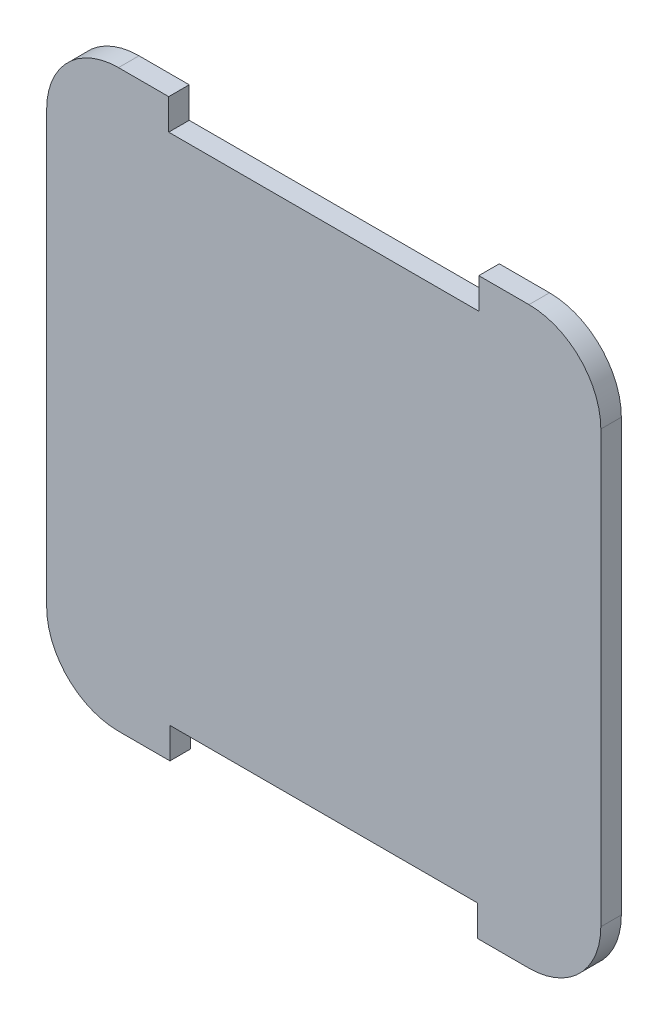
ISO-10303-21;
HEADER;
FILE_DESCRIPTION(('STEP AP214'),'2;1');
FILE_NAME('part.step','',(''),(''),'','','');
FILE_SCHEMA(('AUTOMOTIVE_DESIGN { 1 0 10303 214 1 1 1 1 }'));
ENDSEC;
DATA;
#1=APPLICATION_CONTEXT('core data for automotive mechanical design processes');
#2=APPLICATION_PROTOCOL_DEFINITION('international standard','automotive_design',2000,#1);
#3=PRODUCT_CONTEXT('',#1,'mechanical');
#4=PRODUCT('Part','Part','',(#3));
#5=PRODUCT_RELATED_PRODUCT_CATEGORY('part','',(#4));
#6=PRODUCT_DEFINITION_FORMATION('','',#4);
#7=PRODUCT_DEFINITION_CONTEXT('part definition',#1,'design');
#8=PRODUCT_DEFINITION('design','',#6,#7);
#9=PRODUCT_DEFINITION_SHAPE('','',#8);
#10=(LENGTH_UNIT() NAMED_UNIT(*) SI_UNIT(.MILLI.,.METRE.));
#11=(NAMED_UNIT(*) PLANE_ANGLE_UNIT() SI_UNIT($,.RADIAN.));
#12=(NAMED_UNIT(*) SI_UNIT($,.STERADIAN.) SOLID_ANGLE_UNIT());
#13=UNCERTAINTY_MEASURE_WITH_UNIT(LENGTH_MEASURE(1.E-05),#10,'distance_accuracy_value','');
#14=(GEOMETRIC_REPRESENTATION_CONTEXT(3) GLOBAL_UNCERTAINTY_ASSIGNED_CONTEXT((#13)) GLOBAL_UNIT_ASSIGNED_CONTEXT((#10,
#11,#12)) REPRESENTATION_CONTEXT('',''));
#15=CARTESIAN_POINT('',(0.,0.,0.));
#16=DIRECTION('',(0.,0.,1.));
#17=DIRECTION('',(1.,0.,0.));
#18=AXIS2_PLACEMENT_3D('',#15,#16,#17);
#19=CARTESIAN_POINT('',(-10.,14.,1.));
#20=DIRECTION('',(0.,-1.,0.));
#21=DIRECTION('',(1.,0.,0.));
#22=AXIS2_PLACEMENT_3D('',#19,#20,#21);
#23=PLANE('',#22);
#24=DIRECTION('',(-1.,0.,0.));
#25=VECTOR('',#24,1.);
#26=CARTESIAN_POINT('',(-10.,14.,1.));
#27=LINE('',#26,#25);
#28=CARTESIAN_POINT('',(-7.55375402467479,14.,1.));
#29=VERTEX_POINT('',#28);
#30=CARTESIAN_POINT('',(-10.,14.,1.));
#31=VERTEX_POINT('',#30);
#32=EDGE_CURVE('E212',#29,#31,#27,.T.);
#33=ORIENTED_EDGE('',*,*,#32,.F.);
#34=DIRECTION('',(0.,0.,1.));
#35=VECTOR('',#34,1.);
#36=CARTESIAN_POINT('',(-7.55375402467479,14.,-0.000999999999999916));
#37=LINE('',#36,#35);
#38=CARTESIAN_POINT('',(-7.55375402467479,14.,0.));
#39=VERTEX_POINT('',#38);
#40=EDGE_CURVE('E168',#39,#29,#37,.T.);
#41=ORIENTED_EDGE('',*,*,#40,.F.);
#42=DIRECTION('',(-1.,0.,0.));
#43=VECTOR('',#42,1.);
#44=CARTESIAN_POINT('',(-10.,14.,0.));
#45=LINE('',#44,#43);
#46=CARTESIAN_POINT('',(-10.,14.,0.));
#47=VERTEX_POINT('',#46);
#48=EDGE_CURVE('E173',#39,#47,#45,.T.);
#49=ORIENTED_EDGE('',*,*,#48,.T.);
#50=DIRECTION('',(0.,0.,-1.));
#51=VECTOR('',#50,1.);
#52=CARTESIAN_POINT('',(-10.,14.,1.));
#53=LINE('',#52,#51);
#54=EDGE_CURVE('E45',#31,#47,#53,.T.);
#55=ORIENTED_EDGE('',*,*,#54,.F.);
#56=EDGE_LOOP('',(#33,#41,#49,#55));
#57=FACE_BOUND('',#56,.T.);
#58=ADVANCED_FACE('F37',(#57),#23,.F.);
#59=CARTESIAN_POINT('',(-9.99999999999997,-14.,1.));
#60=DIRECTION('',(0.,1.,0.));
#61=DIRECTION('',(-1.,0.,0.));
#62=AXIS2_PLACEMENT_3D('',#59,#60,#61);
#63=PLANE('',#62);
#64=DIRECTION('',(1.,0.,0.));
#65=VECTOR('',#64,1.);
#66=CARTESIAN_POINT('',(-9.99999999999997,-14.,0.));
#67=LINE('',#66,#65);
#68=CARTESIAN_POINT('',(-9.99999999999997,-14.,0.));
#69=VERTEX_POINT('',#68);
#70=CARTESIAN_POINT('',(-7.49320369879274,-14.,0.));
#71=VERTEX_POINT('',#70);
#72=EDGE_CURVE('E244',#69,#71,#67,.T.);
#73=ORIENTED_EDGE('',*,*,#72,.T.);
#74=DIRECTION('',(0.,0.,1.));
#75=VECTOR('',#74,1.);
#76=CARTESIAN_POINT('',(-7.49320369879274,-14.,-0.000999999999999916));
#77=LINE('',#76,#75);
#78=CARTESIAN_POINT('',(-7.49320369879274,-14.,1.));
#79=VERTEX_POINT('',#78);
#80=EDGE_CURVE('E201',#71,#79,#77,.T.);
#81=ORIENTED_EDGE('',*,*,#80,.T.);
#82=DIRECTION('',(1.,0.,0.));
#83=VECTOR('',#82,1.);
#84=CARTESIAN_POINT('',(-9.99999999999997,-14.,1.));
#85=LINE('',#84,#83);
#86=CARTESIAN_POINT('',(-9.99999999999997,-14.,1.));
#87=VERTEX_POINT('',#86);
#88=EDGE_CURVE('E224',#87,#79,#85,.T.);
#89=ORIENTED_EDGE('',*,*,#88,.F.);
#90=DIRECTION('',(0.,0.,-1.));
#91=VECTOR('',#90,1.);
#92=CARTESIAN_POINT('',(-9.99999999999997,-14.,1.));
#93=LINE('',#92,#91);
#94=EDGE_CURVE('E258',#87,#69,#93,.T.);
#95=ORIENTED_EDGE('',*,*,#94,.T.);
#96=EDGE_LOOP('',(#73,#81,#89,#95));
#97=FACE_BOUND('',#96,.T.);
#98=ADVANCED_FACE('F290',(#97),#63,.F.);
#99=CARTESIAN_POINT('',(10.,10.5,1.));
#100=DIRECTION('',(0.,0.,-1.));
#101=DIRECTION('',(-1.,0.,0.));
#102=AXIS2_PLACEMENT_3D('',#99,#100,#101);
#103=CYLINDRICAL_SURFACE('',#102,3.5);
#104=CARTESIAN_POINT('',(10.,10.5,0.));
#105=DIRECTION('',(0.,0.,1.));
#106=DIRECTION('',(1.,0.,0.));
#107=AXIS2_PLACEMENT_3D('',#104,#105,#106);
#108=CIRCLE('',#107,3.5);
#109=CARTESIAN_POINT('',(13.5,10.5,0.));
#110=VERTEX_POINT('',#109);
#111=CARTESIAN_POINT('',(10.,14.,0.));
#112=VERTEX_POINT('',#111);
#113=EDGE_CURVE('E167',#110,#112,#108,.T.);
#114=ORIENTED_EDGE('',*,*,#113,.T.);
#115=DIRECTION('',(0.,0.,-1.));
#116=VECTOR('',#115,1.);
#117=CARTESIAN_POINT('',(10.,14.,1.));
#118=LINE('',#117,#116);
#119=CARTESIAN_POINT('',(10.,14.,1.));
#120=VERTEX_POINT('',#119);
#121=EDGE_CURVE('E11',#120,#112,#118,.T.);
#122=ORIENTED_EDGE('',*,*,#121,.F.);
#123=CARTESIAN_POINT('',(10.,10.5,1.));
#124=DIRECTION('',(0.,0.,1.));
#125=DIRECTION('',(1.,0.,0.));
#126=AXIS2_PLACEMENT_3D('',#123,#124,#125);
#127=CIRCLE('',#126,3.5);
#128=CARTESIAN_POINT('',(13.5,10.5,1.));
#129=VERTEX_POINT('',#128);
#130=EDGE_CURVE('E209',#129,#120,#127,.T.);
#131=ORIENTED_EDGE('',*,*,#130,.F.);
#132=DIRECTION('',(0.,0.,-1.));
#133=VECTOR('',#132,1.);
#134=CARTESIAN_POINT('',(13.5,10.5,1.));
#135=LINE('',#134,#133);
#136=EDGE_CURVE('E231',#129,#110,#135,.T.);
#137=ORIENTED_EDGE('',*,*,#136,.T.);
#138=EDGE_LOOP('',(#114,#122,#131,#137));
#139=FACE_BOUND('',#138,.T.);
#140=ADVANCED_FACE('F39',(#139),#103,.T.);
#141=CARTESIAN_POINT('',(7.55375402467479,14.,0.));
#142=VERTEX_POINT('',#141);
#143=EDGE_CURVE('E234',#112,#142,#45,.T.);
#144=ORIENTED_EDGE('',*,*,#143,.T.);
#145=DIRECTION('',(0.,0.,1.));
#146=VECTOR('',#145,1.);
#147=CARTESIAN_POINT('',(7.55375402467479,14.,-0.000999999999999916));
#148=LINE('',#147,#146);
#149=CARTESIAN_POINT('',(7.55375402467479,14.,1.));
#150=VERTEX_POINT('',#149);
#151=EDGE_CURVE('E183',#142,#150,#148,.T.);
#152=ORIENTED_EDGE('',*,*,#151,.T.);
#153=EDGE_CURVE('E214',#120,#150,#27,.T.);
#154=ORIENTED_EDGE('',*,*,#153,.F.);
#155=ORIENTED_EDGE('',*,*,#121,.T.);
#156=EDGE_LOOP('',(#144,#152,#154,#155));
#157=FACE_BOUND('',#156,.T.);
#158=ADVANCED_FACE('F291',(#157),#23,.F.);
#159=CARTESIAN_POINT('',(-10.,10.5,1.));
#160=DIRECTION('',(0.,0.,-1.));
#161=DIRECTION('',(-1.,0.,0.));
#162=AXIS2_PLACEMENT_3D('',#159,#160,#161);
#163=CYLINDRICAL_SURFACE('',#162,3.5);
#164=CARTESIAN_POINT('',(-10.,10.5,0.));
#165=DIRECTION('',(0.,0.,1.));
#166=DIRECTION('',(1.,0.,0.));
#167=AXIS2_PLACEMENT_3D('',#164,#165,#166);
#168=CIRCLE('',#167,3.5);
#169=CARTESIAN_POINT('',(-13.5,10.5,0.));
#170=VERTEX_POINT('',#169);
#171=EDGE_CURVE('E237',#47,#170,#168,.T.);
#172=ORIENTED_EDGE('',*,*,#171,.T.);
#173=DIRECTION('',(0.,0.,-1.));
#174=VECTOR('',#173,1.);
#175=CARTESIAN_POINT('',(-13.5,10.5,1.));
#176=LINE('',#175,#174);
#177=CARTESIAN_POINT('',(-13.5,10.5,1.));
#178=VERTEX_POINT('',#177);
#179=EDGE_CURVE('E264',#178,#170,#176,.T.);
#180=ORIENTED_EDGE('',*,*,#179,.F.);
#181=CARTESIAN_POINT('',(-10.,10.5,1.));
#182=DIRECTION('',(0.,0.,1.));
#183=DIRECTION('',(1.,0.,0.));
#184=AXIS2_PLACEMENT_3D('',#181,#182,#183);
#185=CIRCLE('',#184,3.5);
#186=EDGE_CURVE('E217',#31,#178,#185,.T.);
#187=ORIENTED_EDGE('',*,*,#186,.F.);
#188=ORIENTED_EDGE('',*,*,#54,.T.);
#189=EDGE_LOOP('',(#172,#180,#187,#188));
#190=FACE_BOUND('',#189,.T.);
#191=ADVANCED_FACE('F270',(#190),#163,.T.);
#192=CARTESIAN_POINT('',(-13.5,10.5,1.));
#193=DIRECTION('',(1.,0.,0.));
#194=DIRECTION('',(0.,1.,0.));
#195=AXIS2_PLACEMENT_3D('',#192,#193,#194);
#196=PLANE('',#195);
#197=DIRECTION('',(0.,-1.,0.));
#198=VECTOR('',#197,1.);
#199=CARTESIAN_POINT('',(-13.5,10.5,0.));
#200=LINE('',#199,#198);
#201=CARTESIAN_POINT('',(-13.5,-10.5,0.));
#202=VERTEX_POINT('',#201);
#203=EDGE_CURVE('E239',#170,#202,#200,.T.);
#204=ORIENTED_EDGE('',*,*,#203,.T.);
#205=DIRECTION('',(0.,0.,-1.));
#206=VECTOR('',#205,1.);
#207=CARTESIAN_POINT('',(-13.5,-10.5,1.));
#208=LINE('',#207,#206);
#209=CARTESIAN_POINT('',(-13.5,-10.5,1.));
#210=VERTEX_POINT('',#209);
#211=EDGE_CURVE('E261',#210,#202,#208,.T.);
#212=ORIENTED_EDGE('',*,*,#211,.F.);
#213=DIRECTION('',(0.,-1.,0.));
#214=VECTOR('',#213,1.);
#215=CARTESIAN_POINT('',(-13.5,10.5,1.));
#216=LINE('',#215,#214);
#217=EDGE_CURVE('E219',#178,#210,#216,.T.);
#218=ORIENTED_EDGE('',*,*,#217,.F.);
#219=ORIENTED_EDGE('',*,*,#179,.T.);
#220=EDGE_LOOP('',(#204,#212,#218,#219));
#221=FACE_BOUND('',#220,.T.);
#222=ADVANCED_FACE('F279',(#221),#196,.F.);
#223=CARTESIAN_POINT('',(-10.,-10.5,1.));
#224=DIRECTION('',(0.,0.,-1.));
#225=DIRECTION('',(-1.,0.,0.));
#226=AXIS2_PLACEMENT_3D('',#223,#224,#225);
#227=CYLINDRICAL_SURFACE('',#226,3.5);
#228=CARTESIAN_POINT('',(-10.,-10.5,0.));
#229=DIRECTION('',(0.,0.,1.));
#230=DIRECTION('',(1.,0.,0.));
#231=AXIS2_PLACEMENT_3D('',#228,#229,#230);
#232=CIRCLE('',#231,3.5);
#233=EDGE_CURVE('E241',#202,#69,#232,.T.);
#234=ORIENTED_EDGE('',*,*,#233,.T.);
#235=ORIENTED_EDGE('',*,*,#94,.F.);
#236=CARTESIAN_POINT('',(-10.,-10.5,1.));
#237=DIRECTION('',(0.,0.,1.));
#238=DIRECTION('',(1.,0.,0.));
#239=AXIS2_PLACEMENT_3D('',#236,#237,#238);
#240=CIRCLE('',#239,3.5);
#241=EDGE_CURVE('E221',#210,#87,#240,.T.);
#242=ORIENTED_EDGE('',*,*,#241,.F.);
#243=ORIENTED_EDGE('',*,*,#211,.T.);
#244=EDGE_LOOP('',(#234,#235,#242,#243));
#245=FACE_BOUND('',#244,.T.);
#246=ADVANCED_FACE('F283',(#245),#227,.T.);
#247=CARTESIAN_POINT('',(7.49320369879274,-14.,1.));
#248=VERTEX_POINT('',#247);
#249=CARTESIAN_POINT('',(9.99999999999996,-14.,1.));
#250=VERTEX_POINT('',#249);
#251=EDGE_CURVE('E223',#248,#250,#85,.T.);
#252=ORIENTED_EDGE('',*,*,#251,.F.);
#253=DIRECTION('',(0.,0.,1.));
#254=VECTOR('',#253,1.);
#255=CARTESIAN_POINT('',(7.49320369879274,-14.,-0.000999999999999916));
#256=LINE('',#255,#254);
#257=CARTESIAN_POINT('',(7.49320369879274,-14.,0.));
#258=VERTEX_POINT('',#257);
#259=EDGE_CURVE('E205',#258,#248,#256,.T.);
#260=ORIENTED_EDGE('',*,*,#259,.F.);
#261=CARTESIAN_POINT('',(9.99999999999996,-14.,0.));
#262=VERTEX_POINT('',#261);
#263=EDGE_CURVE('E243',#258,#262,#67,.T.);
#264=ORIENTED_EDGE('',*,*,#263,.T.);
#265=DIRECTION('',(0.,0.,-1.));
#266=VECTOR('',#265,1.);
#267=CARTESIAN_POINT('',(9.99999999999996,-14.,1.));
#268=LINE('',#267,#266);
#269=EDGE_CURVE('E255',#250,#262,#268,.T.);
#270=ORIENTED_EDGE('',*,*,#269,.F.);
#271=EDGE_LOOP('',(#252,#260,#264,#270));
#272=FACE_BOUND('',#271,.T.);
#273=ADVANCED_FACE('F297',(#272),#63,.F.);
#274=CARTESIAN_POINT('',(10.,-10.5,1.));
#275=DIRECTION('',(0.,0.,-1.));
#276=DIRECTION('',(-1.,0.,0.));
#277=AXIS2_PLACEMENT_3D('',#274,#275,#276);
#278=CYLINDRICAL_SURFACE('',#277,3.5);
#279=CARTESIAN_POINT('',(10.,-10.5,0.));
#280=DIRECTION('',(0.,0.,1.));
#281=DIRECTION('',(1.,0.,0.));
#282=AXIS2_PLACEMENT_3D('',#279,#280,#281);
#283=CIRCLE('',#282,3.5);
#284=CARTESIAN_POINT('',(13.5,-10.5,0.));
#285=VERTEX_POINT('',#284);
#286=EDGE_CURVE('E247',#262,#285,#283,.T.);
#287=ORIENTED_EDGE('',*,*,#286,.T.);
#288=DIRECTION('',(0.,0.,-1.));
#289=VECTOR('',#288,1.);
#290=CARTESIAN_POINT('',(13.5,-10.5,1.));
#291=LINE('',#290,#289);
#292=CARTESIAN_POINT('',(13.5,-10.5,1.));
#293=VERTEX_POINT('',#292);
#294=EDGE_CURVE('E252',#293,#285,#291,.T.);
#295=ORIENTED_EDGE('',*,*,#294,.F.);
#296=CARTESIAN_POINT('',(10.,-10.5,1.));
#297=DIRECTION('',(0.,0.,1.));
#298=DIRECTION('',(1.,0.,0.));
#299=AXIS2_PLACEMENT_3D('',#296,#297,#298);
#300=CIRCLE('',#299,3.5);
#301=EDGE_CURVE('E227',#250,#293,#300,.T.);
#302=ORIENTED_EDGE('',*,*,#301,.F.);
#303=ORIENTED_EDGE('',*,*,#269,.T.);
#304=EDGE_LOOP('',(#287,#295,#302,#303));
#305=FACE_BOUND('',#304,.T.);
#306=ADVANCED_FACE('F318',(#305),#278,.T.);
#307=CARTESIAN_POINT('',(13.5,10.5,1.));
#308=DIRECTION('',(-1.,0.,0.));
#309=DIRECTION('',(0.,-1.,0.));
#310=AXIS2_PLACEMENT_3D('',#307,#308,#309);
#311=PLANE('',#310);
#312=DIRECTION('',(0.,1.,0.));
#313=VECTOR('',#312,1.);
#314=CARTESIAN_POINT('',(13.5,10.5,0.));
#315=LINE('',#314,#313);
#316=EDGE_CURVE('E213',#285,#110,#315,.T.);
#317=ORIENTED_EDGE('',*,*,#316,.T.);
#318=ORIENTED_EDGE('',*,*,#136,.F.);
#319=DIRECTION('',(0.,1.,0.));
#320=VECTOR('',#319,1.);
#321=CARTESIAN_POINT('',(13.5,10.5,1.));
#322=LINE('',#321,#320);
#323=EDGE_CURVE('E229',#293,#129,#322,.T.);
#324=ORIENTED_EDGE('',*,*,#323,.F.);
#325=ORIENTED_EDGE('',*,*,#294,.T.);
#326=EDGE_LOOP('',(#317,#318,#324,#325));
#327=FACE_BOUND('',#326,.T.);
#328=ADVANCED_FACE('F314',(#327),#311,.F.);
#329=CARTESIAN_POINT('',(10.,10.5,1.));
#330=DIRECTION('',(0.,0.,1.));
#331=DIRECTION('',(1.,0.,0.));
#332=AXIS2_PLACEMENT_3D('',#329,#330,#331);
#333=PLANE('',#332);
#334=DIRECTION('',(0.,-1.,0.));
#335=VECTOR('',#334,1.);
#336=CARTESIAN_POINT('',(-7.55375402467479,14.,1.));
#337=LINE('',#336,#335);
#338=CARTESIAN_POINT('',(-7.55375402467479,12.5,1.));
#339=VERTEX_POINT('',#338);
#340=EDGE_CURVE('E156',#29,#339,#337,.T.);
#341=ORIENTED_EDGE('',*,*,#340,.F.);
#342=ORIENTED_EDGE('',*,*,#32,.T.);
#343=ORIENTED_EDGE('',*,*,#186,.T.);
#344=ORIENTED_EDGE('',*,*,#217,.T.);
#345=ORIENTED_EDGE('',*,*,#241,.T.);
#346=ORIENTED_EDGE('',*,*,#88,.T.);
#347=DIRECTION('',(0.00216250658221699,-0.999997661779907,0.));
#348=VECTOR('',#347,1.);
#349=CARTESIAN_POINT('',(-7.49320369879274,-14.,1.));
#350=LINE('',#349,#348);
#351=CARTESIAN_POINT('',(-7.4964474662507,-12.5,1.));
#352=VERTEX_POINT('',#351);
#353=EDGE_CURVE('E193',#352,#79,#350,.T.);
#354=ORIENTED_EDGE('',*,*,#353,.F.);
#355=DIRECTION('',(-1.,0.,0.));
#356=VECTOR('',#355,1.);
#357=CARTESIAN_POINT('',(-7.4964474662507,-12.5,1.));
#358=LINE('',#357,#356);
#359=CARTESIAN_POINT('',(7.4964474662507,-12.5,1.));
#360=VERTEX_POINT('',#359);
#361=EDGE_CURVE('E198',#360,#352,#358,.T.);
#362=ORIENTED_EDGE('',*,*,#361,.F.);
#363=DIRECTION('',(0.00216250658221641,0.999997661779907,0.));
#364=VECTOR('',#363,1.);
#365=CARTESIAN_POINT('',(7.49320369879274,-14.,1.));
#366=LINE('',#365,#364);
#367=EDGE_CURVE('E195',#248,#360,#366,.T.);
#368=ORIENTED_EDGE('',*,*,#367,.F.);
#369=ORIENTED_EDGE('',*,*,#251,.T.);
#370=ORIENTED_EDGE('',*,*,#301,.T.);
#371=ORIENTED_EDGE('',*,*,#323,.T.);
#372=ORIENTED_EDGE('',*,*,#130,.T.);
#373=ORIENTED_EDGE('',*,*,#153,.T.);
#374=DIRECTION('',(0.,1.,0.));
#375=VECTOR('',#374,1.);
#376=CARTESIAN_POINT('',(7.55375402467479,12.5,1.));
#377=LINE('',#376,#375);
#378=CARTESIAN_POINT('',(7.55375402467479,12.5,1.));
#379=VERTEX_POINT('',#378);
#380=EDGE_CURVE('E161',#379,#150,#377,.T.);
#381=ORIENTED_EDGE('',*,*,#380,.F.);
#382=DIRECTION('',(1.,0.,0.));
#383=VECTOR('',#382,1.);
#384=CARTESIAN_POINT('',(7.55375402467479,12.5,1.));
#385=LINE('',#384,#383);
#386=EDGE_CURVE('E175',#339,#379,#385,.T.);
#387=ORIENTED_EDGE('',*,*,#386,.F.);
#388=EDGE_LOOP('',(#341,#342,#343,#344,#345,#346,#354,#362,#368,#369,#370,#371,#372,#373,#381,#387));
#389=FACE_BOUND('',#388,.T.);
#390=ADVANCED_FACE('F287',(#389),#333,.T.);
#391=CARTESIAN_POINT('',(10.,10.5,0.));
#392=DIRECTION('',(0.,0.,1.));
#393=DIRECTION('',(1.,0.,0.));
#394=AXIS2_PLACEMENT_3D('',#391,#392,#393);
#395=PLANE('',#394);
#396=ORIENTED_EDGE('',*,*,#48,.F.);
#397=DIRECTION('',(0.,1.,0.));
#398=VECTOR('',#397,1.);
#399=CARTESIAN_POINT('',(-7.55375402467479,14.,0.));
#400=LINE('',#399,#398);
#401=CARTESIAN_POINT('',(-7.55375402467479,12.5,0.));
#402=VERTEX_POINT('',#401);
#403=EDGE_CURVE('E153',#402,#39,#400,.T.);
#404=ORIENTED_EDGE('',*,*,#403,.F.);
#405=DIRECTION('',(-1.,0.,0.));
#406=VECTOR('',#405,1.);
#407=CARTESIAN_POINT('',(7.55375402467479,12.5,0.));
#408=LINE('',#407,#406);
#409=CARTESIAN_POINT('',(7.55375402467479,12.5,0.));
#410=VERTEX_POINT('',#409);
#411=EDGE_CURVE('E164',#410,#402,#408,.T.);
#412=ORIENTED_EDGE('',*,*,#411,.F.);
#413=DIRECTION('',(0.,-1.,0.));
#414=VECTOR('',#413,1.);
#415=CARTESIAN_POINT('',(7.55375402467479,12.5,0.));
#416=LINE('',#415,#414);
#417=EDGE_CURVE('E52',#142,#410,#416,.T.);
#418=ORIENTED_EDGE('',*,*,#417,.F.);
#419=ORIENTED_EDGE('',*,*,#143,.F.);
#420=ORIENTED_EDGE('',*,*,#113,.F.);
#421=ORIENTED_EDGE('',*,*,#316,.F.);
#422=ORIENTED_EDGE('',*,*,#286,.F.);
#423=ORIENTED_EDGE('',*,*,#263,.F.);
#424=DIRECTION('',(-0.00216250658221641,-0.999997661779907,0.));
#425=VECTOR('',#424,1.);
#426=CARTESIAN_POINT('',(7.49320369879274,-14.,0.));
#427=LINE('',#426,#425);
#428=CARTESIAN_POINT('',(7.4964474662507,-12.5,0.));
#429=VERTEX_POINT('',#428);
#430=EDGE_CURVE('E187',#429,#258,#427,.T.);
#431=ORIENTED_EDGE('',*,*,#430,.F.);
#432=DIRECTION('',(1.,0.,0.));
#433=VECTOR('',#432,1.);
#434=CARTESIAN_POINT('',(-7.4964474662507,-12.5,0.));
#435=LINE('',#434,#433);
#436=CARTESIAN_POINT('',(-7.4964474662507,-12.5,0.));
#437=VERTEX_POINT('',#436);
#438=EDGE_CURVE('E60',#437,#429,#435,.T.);
#439=ORIENTED_EDGE('',*,*,#438,.F.);
#440=DIRECTION('',(-0.00216250658221699,0.999997661779907,0.));
#441=VECTOR('',#440,1.);
#442=CARTESIAN_POINT('',(-7.49320369879274,-14.,0.));
#443=LINE('',#442,#441);
#444=EDGE_CURVE('E190',#71,#437,#443,.T.);
#445=ORIENTED_EDGE('',*,*,#444,.F.);
#446=ORIENTED_EDGE('',*,*,#72,.F.);
#447=ORIENTED_EDGE('',*,*,#233,.F.);
#448=ORIENTED_EDGE('',*,*,#203,.F.);
#449=ORIENTED_EDGE('',*,*,#171,.F.);
#450=EDGE_LOOP('',(#396,#404,#412,#418,#419,#420,#421,#422,#423,#431,#439,#445,#446,#447,#448,#449));
#451=FACE_BOUND('',#450,.T.);
#452=ADVANCED_FACE('F171',(#451),#395,.F.);
#453=CARTESIAN_POINT('',(-7.49320369879274,-14.,-0.000999999999999916));
#454=DIRECTION('',(-0.999997661779907,-0.00216250658221699,0.));
#455=DIRECTION('',(0.00216250658221699,-0.999997661779907,0.));
#456=AXIS2_PLACEMENT_3D('',#453,#454,#455);
#457=PLANE('',#456);
#458=ORIENTED_EDGE('',*,*,#444,.T.);
#459=DIRECTION('',(0.,0.,1.));
#460=VECTOR('',#459,1.);
#461=CARTESIAN_POINT('',(-7.4964474662507,-12.5,-0.000999999999999916));
#462=LINE('',#461,#460);
#463=EDGE_CURVE('E177',#437,#352,#462,.T.);
#464=ORIENTED_EDGE('',*,*,#463,.T.);
#465=ORIENTED_EDGE('',*,*,#353,.T.);
#466=ORIENTED_EDGE('',*,*,#80,.F.);
#467=EDGE_LOOP('',(#458,#464,#465,#466));
#468=FACE_BOUND('',#467,.T.);
#469=ADVANCED_FACE('F332',(#468),#457,.F.);
#470=CARTESIAN_POINT('',(-7.4964474662507,-12.5,-0.000999999999999916));
#471=DIRECTION('',(0.,1.,0.));
#472=DIRECTION('',(0.,0.,1.));
#473=AXIS2_PLACEMENT_3D('',#470,#471,#472);
#474=PLANE('',#473);
#475=ORIENTED_EDGE('',*,*,#438,.T.);
#476=DIRECTION('',(0.,0.,1.));
#477=VECTOR('',#476,1.);
#478=CARTESIAN_POINT('',(7.4964474662507,-12.5,-0.000999999999999916));
#479=LINE('',#478,#477);
#480=EDGE_CURVE('E203',#429,#360,#479,.T.);
#481=ORIENTED_EDGE('',*,*,#480,.T.);
#482=ORIENTED_EDGE('',*,*,#361,.T.);
#483=ORIENTED_EDGE('',*,*,#463,.F.);
#484=EDGE_LOOP('',(#475,#481,#482,#483));
#485=FACE_BOUND('',#484,.T.);
#486=ADVANCED_FACE('F329',(#485),#474,.F.);
#487=CARTESIAN_POINT('',(7.49320369879274,-14.,-0.000999999999999916));
#488=DIRECTION('',(0.999997661779907,-0.00216250658221641,0.));
#489=DIRECTION('',(0.00216250658221641,0.999997661779907,0.));
#490=AXIS2_PLACEMENT_3D('',#487,#488,#489);
#491=PLANE('',#490);
#492=ORIENTED_EDGE('',*,*,#430,.T.);
#493=ORIENTED_EDGE('',*,*,#259,.T.);
#494=ORIENTED_EDGE('',*,*,#367,.T.);
#495=ORIENTED_EDGE('',*,*,#480,.F.);
#496=EDGE_LOOP('',(#492,#493,#494,#495));
#497=FACE_BOUND('',#496,.T.);
#498=ADVANCED_FACE('F327',(#497),#491,.F.);
#499=CARTESIAN_POINT('',(-7.55375402467479,14.,-0.000999999999999916));
#500=DIRECTION('',(-1.,0.,0.));
#501=DIRECTION('',(0.,0.,1.));
#502=AXIS2_PLACEMENT_3D('',#499,#500,#501);
#503=PLANE('',#502);
#504=ORIENTED_EDGE('',*,*,#403,.T.);
#505=ORIENTED_EDGE('',*,*,#40,.T.);
#506=ORIENTED_EDGE('',*,*,#340,.T.);
#507=DIRECTION('',(0.,0.,1.));
#508=VECTOR('',#507,1.);
#509=CARTESIAN_POINT('',(-7.55375402467479,12.5,-0.000999999999999916));
#510=LINE('',#509,#508);
#511=EDGE_CURVE('E149',#402,#339,#510,.T.);
#512=ORIENTED_EDGE('',*,*,#511,.F.);
#513=EDGE_LOOP('',(#504,#505,#506,#512));
#514=FACE_BOUND('',#513,.T.);
#515=ADVANCED_FACE('F151',(#514),#503,.F.);
#516=CARTESIAN_POINT('',(7.55375402467479,12.5,-0.000999999999999916));
#517=DIRECTION('',(1.,0.,0.));
#518=DIRECTION('',(0.,0.,-1.));
#519=AXIS2_PLACEMENT_3D('',#516,#517,#518);
#520=PLANE('',#519);
#521=ORIENTED_EDGE('',*,*,#417,.T.);
#522=DIRECTION('',(0.,0.,1.));
#523=VECTOR('',#522,1.);
#524=CARTESIAN_POINT('',(7.55375402467479,12.5,-0.000999999999999916));
#525=LINE('',#524,#523);
#526=EDGE_CURVE('E160',#410,#379,#525,.T.);
#527=ORIENTED_EDGE('',*,*,#526,.T.);
#528=ORIENTED_EDGE('',*,*,#380,.T.);
#529=ORIENTED_EDGE('',*,*,#151,.F.);
#530=EDGE_LOOP('',(#521,#527,#528,#529));
#531=FACE_BOUND('',#530,.T.);
#532=ADVANCED_FACE('F409',(#531),#520,.F.);
#533=CARTESIAN_POINT('',(7.55375402467479,12.5,-0.000999999999999916));
#534=DIRECTION('',(0.,-1.,0.));
#535=DIRECTION('',(0.,0.,-1.));
#536=AXIS2_PLACEMENT_3D('',#533,#534,#535);
#537=PLANE('',#536);
#538=ORIENTED_EDGE('',*,*,#411,.T.);
#539=ORIENTED_EDGE('',*,*,#511,.T.);
#540=ORIENTED_EDGE('',*,*,#386,.T.);
#541=ORIENTED_EDGE('',*,*,#526,.F.);
#542=EDGE_LOOP('',(#538,#539,#540,#541));
#543=FACE_BOUND('',#542,.T.);
#544=ADVANCED_FACE('F165',(#543),#537,.F.);
#545=CLOSED_SHELL('',(#58,#98,#140,#158,#191,#222,#246,#273,#306,#328,#390,#452,#469,#486,#498,
#515,#532,#544));
#546=MANIFOLD_SOLID_BREP('B2',#545);
#547=ADVANCED_BREP_SHAPE_REPRESENTATION('',(#18,#546),#14);
#548=SHAPE_DEFINITION_REPRESENTATION(#9,#547);
ENDSEC;
END-ISO-10303-21;
